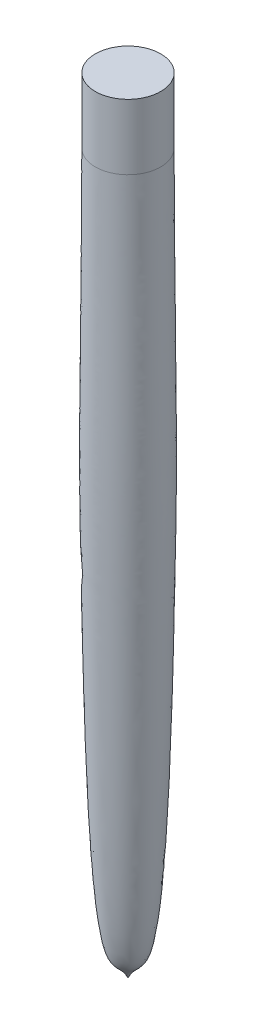
ISO-10303-21;
HEADER;
FILE_DESCRIPTION(('STEP AP214'),'2;1');
FILE_NAME('part.step','',(''),(''),'','','');
FILE_SCHEMA(('AUTOMOTIVE_DESIGN { 1 0 10303 214 1 1 1 1 }'));
ENDSEC;
DATA;
#1=APPLICATION_CONTEXT('core data for automotive mechanical design processes');
#2=APPLICATION_PROTOCOL_DEFINITION('international standard','automotive_design',2000,#1);
#3=PRODUCT_CONTEXT('',#1,'mechanical');
#4=PRODUCT('Part','Part','',(#3));
#5=PRODUCT_RELATED_PRODUCT_CATEGORY('part','',(#4));
#6=PRODUCT_DEFINITION_FORMATION('','',#4);
#7=PRODUCT_DEFINITION_CONTEXT('part definition',#1,'design');
#8=PRODUCT_DEFINITION('design','',#6,#7);
#9=PRODUCT_DEFINITION_SHAPE('','',#8);
#10=(LENGTH_UNIT() NAMED_UNIT(*) SI_UNIT(.MILLI.,.METRE.));
#11=(NAMED_UNIT(*) PLANE_ANGLE_UNIT() SI_UNIT($,.RADIAN.));
#12=(NAMED_UNIT(*) SI_UNIT($,.STERADIAN.) SOLID_ANGLE_UNIT());
#13=UNCERTAINTY_MEASURE_WITH_UNIT(LENGTH_MEASURE(1.E-05),#10,'distance_accuracy_value','');
#14=(GEOMETRIC_REPRESENTATION_CONTEXT(3) GLOBAL_UNCERTAINTY_ASSIGNED_CONTEXT((#13)) GLOBAL_UNIT_ASSIGNED_CONTEXT((#10,
#11,#12)) REPRESENTATION_CONTEXT('',''));
#15=CARTESIAN_POINT('',(0.,0.,0.));
#16=DIRECTION('',(0.,0.,1.));
#17=DIRECTION('',(1.,0.,0.));
#18=AXIS2_PLACEMENT_3D('',#15,#16,#17);
#19=CARTESIAN_POINT('',(0.,0.,0.));
#20=DIRECTION('',(0.,1.,0.));
#21=DIRECTION('',(0.,0.,1.));
#22=AXIS2_PLACEMENT_3D('',#19,#20,#21);
#23=PLANE('',#22);
#24=CARTESIAN_POINT('',(0.,0.,0.));
#25=DIRECTION('',(0.,1.,0.));
#26=DIRECTION('',(0.,0.,1.));
#27=AXIS2_PLACEMENT_3D('',#24,#25,#26);
#28=CIRCLE('',#27,6.35);
#29=CARTESIAN_POINT('',(0.,0.,6.35));
#30=VERTEX_POINT('',#29);
#31=EDGE_CURVE('E43',#30,#30,#28,.T.);
#32=ORIENTED_EDGE('',*,*,#31,.T.);
#33=EDGE_LOOP('',(#32));
#34=FACE_BOUND('',#33,.T.);
#35=ADVANCED_FACE('F37',(#34),#23,.T.);
#36=CARTESIAN_POINT('',(-6.35,-12.6999999999998,0.));
#37=CARTESIAN_POINT('',(-6.53769198933756,-63.0260292673204,0.));
#38=CARTESIAN_POINT('',(-7.18075521828725,-54.9912675166269,0.));
#39=CARTESIAN_POINT('',(-5.11424626082821,-152.212684002192,0.));
#40=CARTESIAN_POINT('',(-1.18141237519958,-149.801170135497,0.));
#41=CARTESIAN_POINT('',(0.,-152.4,0.));
#42=B_SPLINE_CURVE_WITH_KNOTS('',3,(#36,#37,#38,#39,#40,#41),.UNSPECIFIED.,.F.,.F.,(4,1,1,4),
(0.,0.583214855931437,0.878924179038534,1.),.UNSPECIFIED.);
#43=CARTESIAN_POINT('',(0.,0.,0.));
#44=DIRECTION('',(0.,1.,0.));
#45=AXIS1_PLACEMENT('',#43,#44);
#46=SURFACE_OF_REVOLUTION('',#42,#45);
#47=CARTESIAN_POINT('',(0.,-152.4,0.));
#48=VERTEX_POINT('',#47);
#49=VERTEX_LOOP('',#48);
#50=FACE_BOUND('',#49,.T.);
#51=CARTESIAN_POINT('',(0.,-12.6999999999998,0.));
#52=DIRECTION('',(0.,1.,0.));
#53=DIRECTION('',(0.,0.,1.));
#54=AXIS2_PLACEMENT_3D('',#51,#52,#53);
#55=CIRCLE('',#54,6.35);
#56=CARTESIAN_POINT('',(0.,-12.6999999999998,6.35));
#57=VERTEX_POINT('',#56);
#58=EDGE_CURVE('E11',#57,#57,#55,.T.);
#59=ORIENTED_EDGE('',*,*,#58,.F.);
#60=EDGE_LOOP('',(#59));
#61=FACE_BOUND('',#60,.T.);
#62=ADVANCED_FACE('F46',(#50,#61),#46,.F.);
#63=CARTESIAN_POINT('',(0.,0.,0.));
#64=DIRECTION('',(0.,1.,0.));
#65=DIRECTION('',(0.,0.,1.));
#66=AXIS2_PLACEMENT_3D('',#63,#64,#65);
#67=CYLINDRICAL_SURFACE('',#66,6.35);
#68=ORIENTED_EDGE('',*,*,#58,.T.);
#69=EDGE_LOOP('',(#68));
#70=FACE_BOUND('',#69,.T.);
#71=ORIENTED_EDGE('',*,*,#31,.F.);
#72=EDGE_LOOP('',(#71));
#73=FACE_BOUND('',#72,.T.);
#74=ADVANCED_FACE('F49',(#70,#73),#67,.T.);
#75=CLOSED_SHELL('',(#35,#62,#74));
#76=MANIFOLD_SOLID_BREP('B2',#75);
#77=ADVANCED_BREP_SHAPE_REPRESENTATION('',(#18,#76),#14);
#78=SHAPE_DEFINITION_REPRESENTATION(#9,#77);
ENDSEC;
END-ISO-10303-21;
